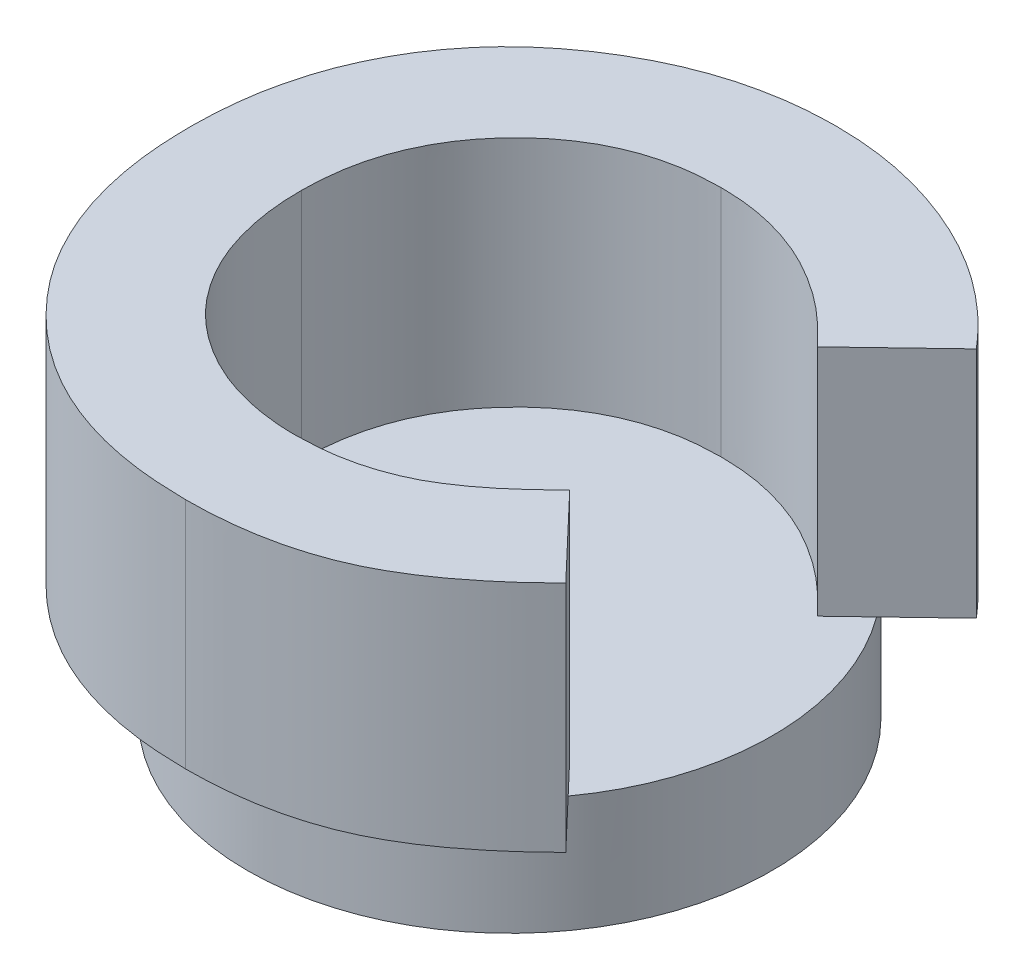
ISO-10303-21;
HEADER;
FILE_DESCRIPTION(('STEP AP214'),'2;1');
FILE_NAME('part.step','',(''),(''),'','','');
FILE_SCHEMA(('AUTOMOTIVE_DESIGN { 1 0 10303 214 1 1 1 1 }'));
ENDSEC;
DATA;
#1=APPLICATION_CONTEXT('core data for automotive mechanical design processes');
#2=APPLICATION_PROTOCOL_DEFINITION('international standard','automotive_design',2000,#1);
#3=PRODUCT_CONTEXT('',#1,'mechanical');
#4=PRODUCT('Part','Part','',(#3));
#5=PRODUCT_RELATED_PRODUCT_CATEGORY('part','',(#4));
#6=PRODUCT_DEFINITION_FORMATION('','',#4);
#7=PRODUCT_DEFINITION_CONTEXT('part definition',#1,'design');
#8=PRODUCT_DEFINITION('design','',#6,#7);
#9=PRODUCT_DEFINITION_SHAPE('','',#8);
#10=(LENGTH_UNIT() NAMED_UNIT(*) SI_UNIT(.MILLI.,.METRE.));
#11=(NAMED_UNIT(*) PLANE_ANGLE_UNIT() SI_UNIT($,.RADIAN.));
#12=(NAMED_UNIT(*) SI_UNIT($,.STERADIAN.) SOLID_ANGLE_UNIT());
#13=UNCERTAINTY_MEASURE_WITH_UNIT(LENGTH_MEASURE(1.E-05),#10,'distance_accuracy_value','');
#14=(GEOMETRIC_REPRESENTATION_CONTEXT(3) GLOBAL_UNCERTAINTY_ASSIGNED_CONTEXT((#13)) GLOBAL_UNIT_ASSIGNED_CONTEXT((#10,
#11,#12)) REPRESENTATION_CONTEXT('',''));
#15=CARTESIAN_POINT('',(0.,0.,0.));
#16=DIRECTION('',(0.,0.,1.));
#17=DIRECTION('',(1.,0.,0.));
#18=AXIS2_PLACEMENT_3D('',#15,#16,#17);
#19=CARTESIAN_POINT('',(0.,10.,0.));
#20=DIRECTION('',(0.,1.,0.));
#21=DIRECTION('',(0.,0.,1.));
#22=AXIS2_PLACEMENT_3D('',#19,#20,#21);
#23=PLANE('',#22);
#24=CARTESIAN_POINT('',(0.,10.,0.));
#25=DIRECTION('',(0.,1.,0.));
#26=DIRECTION('',(0.,0.,1.));
#27=AXIS2_PLACEMENT_3D('',#24,#25,#26);
#28=CIRCLE('',#27,22.5);
#29=CARTESIAN_POINT('',(18.2151132131534,10.,13.2083174792251));
#30=VERTEX_POINT('',#29);
#31=CARTESIAN_POINT('',(18.1408065157428,10.,-13.3101892908548));
#32=VERTEX_POINT('',#31);
#33=EDGE_CURVE('E52',#30,#32,#28,.T.);
#34=ORIENTED_EDGE('',*,*,#33,.T.);
#35=DIRECTION('',(-0.722880768094852,0.,0.690972788985642));
#36=VECTOR('',#35,1.);
#37=CARTESIAN_POINT('',(22.5143564905709,10.,-17.490690636657));
#38=LINE('',#37,#36);
#39=CARTESIAN_POINT('',(15.5499634617247,10.,-10.83370612811));
#40=VERTEX_POINT('',#39);
#41=EDGE_CURVE('E11',#32,#40,#38,.T.);
#42=ORIENTED_EDGE('',*,*,#41,.T.);
#43=CARTESIAN_POINT('',(15.5499634617247,10.,-10.83370612811));
#44=CARTESIAN_POINT('',(14.9591869074458,10.,-11.4445700753948));
#45=CARTESIAN_POINT('',(13.8052152127126,10.,-12.6377787418424));
#46=CARTESIAN_POINT('',(11.9457325423966,10.,-14.2174818623852));
#47=CARTESIAN_POINT('',(10.0119382698477,10.,-15.5339506716564));
#48=CARTESIAN_POINT('',(8.04145050264836,10.,-16.6426723212077));
#49=CARTESIAN_POINT('',(5.99882587807109,10.,-17.4814992675733));
#50=CARTESIAN_POINT('',(3.90768269906654,10.,-18.0927665928095));
#51=CARTESIAN_POINT('',(1.75466840134324,10.,-18.4654331768366));
#52=CARTESIAN_POINT('',(0.297591136050955,10.,-18.5080728293864));
#53=CARTESIAN_POINT('',(-0.435279593830849,10.,-18.529519429392));
#54=B_SPLINE_CURVE_WITH_KNOTS('',3,(#43,#44,#45,#46,#47,#48,#49,#50,#51,#52,#53),.UNSPECIFIED.,
.F.,.F.,(4,1,1,1,1,1,1,1,4),(0.,0.139406438181739,0.272304448374159,0.399525336271758,
0.522810878257822,0.642662716591868,0.761022620809522,0.879800796783804,1.),.UNSPECIFIED.);
#55=CARTESIAN_POINT('',(-0.435279593830849,10.,-18.529519429392));
#56=VERTEX_POINT('',#55);
#57=EDGE_CURVE('E277',#40,#56,#54,.T.);
#58=ORIENTED_EDGE('',*,*,#57,.T.);
#59=CARTESIAN_POINT('',(-0.435279593830849,10.,-18.529519429392));
#60=CARTESIAN_POINT('',(-1.04731571420529,10.,-18.5125758656857));
#61=CARTESIAN_POINT('',(-2.25510156534147,10.,-18.4791396095057));
#62=CARTESIAN_POINT('',(-4.02844769503839,10.,-18.2340188725268));
#63=CARTESIAN_POINT('',(-5.72474491644711,9.99999999999999,-17.8171803918288));
#64=CARTESIAN_POINT('',(-7.34979992377127,10.,-17.2426997510778));
#65=CARTESIAN_POINT('',(-8.89883092286301,10.,-16.4993522927301));
#66=CARTESIAN_POINT('',(-10.3750856497332,10.,-15.5877133483766));
#67=CARTESIAN_POINT('',(-11.7749244595818,10.,-14.5160163142426));
#68=CARTESIAN_POINT('',(-13.0798562926369,10.,-13.2898062000789));
#69=CARTESIAN_POINT('',(-14.2735620734045,10.,-11.9500795045214));
#70=CARTESIAN_POINT('',(-15.3282771382401,10.,-10.5205943163294));
#71=CARTESIAN_POINT('',(-16.2117701912234,10.,-9.00462550616221));
#72=CARTESIAN_POINT('',(-16.9368385688756,10.,-7.41752569177955));
#73=CARTESIAN_POINT('',(-17.501638806587,10.,-5.75194898966486));
#74=CARTESIAN_POINT('',(-17.9049771366345,10.,-4.00901673202257));
#75=CARTESIAN_POINT('',(-18.1382572476456,10.,-2.1866532212269));
#76=CARTESIAN_POINT('',(-18.1730758676047,10.,-0.947824085566511));
#77=CARTESIAN_POINT('',(-18.1907717145573,10.,-0.318214675118497));
#78=B_SPLINE_CURVE_WITH_KNOTS('',3,(#59,#60,#61,#62,#63,#64,#65,#66,#67,#68,#69,#70,#71,#72,#73,
#74,#75,#76,#77),.UNSPECIFIED.,.F.,.F.,(4,1,1,1,1,1,1,1,1,1,1,1,1,1,1,1,4),(0.,
0.0647145165408359,0.127706968329453,0.188882162817117,0.249158298722329,0.309661028748886,
0.370224886057185,0.432332221972585,0.495781858993871,0.559304076520427,0.621860558361524,
0.683321537332506,0.744522974782334,0.806088371210511,0.868994314670206,0.933419056808136,1.),.UNSPECIFIED.);
#79=CARTESIAN_POINT('',(-18.1907717145573,10.,-0.318214675118497));
#80=VERTEX_POINT('',#79);
#81=EDGE_CURVE('E278',#56,#80,#78,.T.);
#82=ORIENTED_EDGE('',*,*,#81,.T.);
#83=CARTESIAN_POINT('',(-18.1907717145573,10.,-0.318214675118497));
#84=CARTESIAN_POINT('',(-18.1856719732768,10.,0.123689261414383));
#85=CARTESIAN_POINT('',(-18.1756202784338,10.,0.99469099964418));
#86=CARTESIAN_POINT('',(-18.0655867025897,10.,2.28314430851664));
#87=CARTESIAN_POINT('',(-17.8884066994735,10.,3.53324862285155));
#88=CARTESIAN_POINT('',(-17.6319833376791,10.,4.74311036776408));
#89=CARTESIAN_POINT('',(-17.3113234030118,10.,5.91377802029476));
#90=CARTESIAN_POINT('',(-16.9351162857979,10.,7.05535087070262));
#91=CARTESIAN_POINT('',(-16.4631699912956,10.,8.15205495260398));
#92=CARTESIAN_POINT('',(-15.939302483551,10.,9.2166277719864));
#93=CARTESIAN_POINT('',(-15.3300506089892,10.,10.2200211268788));
#94=CARTESIAN_POINT('',(-14.6731646961762,10.,11.1768399650871));
#95=CARTESIAN_POINT('',(-13.9608791714441,10.,12.0823940559434));
#96=CARTESIAN_POINT('',(-13.1885805192552,10.,12.932981466665));
#97=CARTESIAN_POINT('',(-12.3453995972404,10.,13.7153094209763));
#98=CARTESIAN_POINT('',(-11.4531295124361,10.,14.4529034513255));
#99=CARTESIAN_POINT('',(-10.4967189031942,10.,15.1272990807738));
#100=CARTESIAN_POINT('',(-9.49603484163499,10.,15.7554210102447));
#101=CARTESIAN_POINT('',(-8.4424326820309,10.,16.3010758742813));
#102=CARTESIAN_POINT('',(-7.3644990937911,10.,16.7953337643117));
#103=CARTESIAN_POINT('',(-6.245890431161,10.,17.1967446565325));
#104=CARTESIAN_POINT('',(-5.10022642647172,10.,17.5203184557415));
#105=CARTESIAN_POINT('',(-3.93160127908117,10.,17.795469646707));
#106=CARTESIAN_POINT('',(-2.72858474969151,10.,17.9648886910839));
#107=CARTESIAN_POINT('',(-1.50160548504139,10.,18.0931877504378));
#108=CARTESIAN_POINT('',(-0.672373449924424,10.,18.1011094674212));
#109=CARTESIAN_POINT('',(-0.25507459917273,10.,18.1050959552234));
#110=B_SPLINE_CURVE_WITH_KNOTS('',3,(#83,#84,#85,#86,#87,#88,#89,#90,#91,#92,#93,#94,#95,#96,
#97,#98,#99,#100,#101,#102,#103,#104,#105,#106,#107,#108,#109),.UNSPECIFIED.,.F.,.F.,(4,1,1,1,1,
1,1,1,1,1,1,1,1,1,1,1,1,1,1,1,1,1,1,1,4),(0.,0.0459858533955717,0.0906390618643955,
0.134485273386869,0.177331356125942,0.219264832978247,0.260785002358145,0.302316572337849,
0.343435729403752,0.384181473765631,0.424375738997743,0.464181121951782,0.50401198252761,
0.543822462310405,0.583802464576023,0.624418535098885,0.665547559578536,0.706674939653633,
0.747826978897574,0.788895116557047,0.830219357972813,0.871706936947863,0.913733853604737,
0.956587827984187,1.),.UNSPECIFIED.);
#111=CARTESIAN_POINT('',(-0.25507459917273,10.,18.1050959552234));
#112=VERTEX_POINT('',#111);
#113=EDGE_CURVE('E294',#80,#112,#110,.T.);
#114=ORIENTED_EDGE('',*,*,#113,.T.);
#115=CARTESIAN_POINT('',(-0.25507459917273,10.,18.1050959552234));
#116=CARTESIAN_POINT('',(0.452735966373527,10.,18.0846223175129));
#117=CARTESIAN_POINT('',(1.84339966919909,10.,18.0443969433595));
#118=CARTESIAN_POINT('',(3.88439861278427,10.,17.7298402134845));
#119=CARTESIAN_POINT('',(5.82926727261556,10.,17.2124121934386));
#120=CARTESIAN_POINT('',(7.38320802507008,10.,16.6013597674288));
#121=CARTESIAN_POINT('',(8.60067955919089,10.,15.997937563906));
#122=CARTESIAN_POINT('',(9.52752264011862,10.,15.4398017409865));
#123=CARTESIAN_POINT('',(10.4859506236859,10.,14.8154655431374));
#124=CARTESIAN_POINT('',(11.4600448407193,10.,14.1013658461382));
#125=CARTESIAN_POINT('',(12.4607619188372,10.,13.3060721327053));
#126=CARTESIAN_POINT('',(13.470436894132,10.,12.4121659866184));
#127=CARTESIAN_POINT('',(14.5149176252764,10.,11.4490824549399));
#128=CARTESIAN_POINT('',(15.1991465988771,10.,10.761710818309));
#129=CARTESIAN_POINT('',(15.5499634617247,10.,10.4092826539413));
#130=B_SPLINE_CURVE_WITH_KNOTS('',3,(#115,#116,#117,#118,#119,#120,#121,#122,#123,#124,#125,
#126,#127,#128,#129),.UNSPECIFIED.,.F.,.F.,(4,1,1,1,1,1,1,1,1,1,1,1,4),(0.,0.117048429048343,
0.229969725903514,0.340703507658765,0.449355146911558,0.50555651152082,0.565302669775755,
0.628204956476601,0.694728991831127,0.765018833651914,0.839580202195728,0.917749799590947,1.),.UNSPECIFIED.);
#131=CARTESIAN_POINT('',(15.5499634617247,10.,10.4092826539413));
#132=VERTEX_POINT('',#131);
#133=EDGE_CURVE('E302',#112,#132,#130,.T.);
#134=ORIENTED_EDGE('',*,*,#133,.T.);
#135=DIRECTION('',(0.689574074589039,0.,0.724215158398849));
#136=VECTOR('',#135,1.);
#137=CARTESIAN_POINT('',(15.5499634617247,10.,10.4092826539413));
#138=LINE('',#137,#136);
#139=EDGE_CURVE('E269',#132,#30,#138,.T.);
#140=ORIENTED_EDGE('',*,*,#139,.T.);
#141=EDGE_LOOP('',(#34,#42,#58,#82,#114,#134,#140));
#142=FACE_BOUND('',#141,.T.);
#143=ADVANCED_FACE('F43',(#142),#23,.T.);
#144=CARTESIAN_POINT('',(0.,10.,0.));
#145=DIRECTION('',(0.,-1.,0.));
#146=DIRECTION('',(0.,0.,-1.));
#147=AXIS2_PLACEMENT_3D('',#144,#145,#146);
#148=CYLINDRICAL_SURFACE('',#147,22.5);
#149=ORIENTED_EDGE('',*,*,#33,.F.);
#150=EDGE_CURVE('E234',#32,#30,#28,.T.);
#151=ORIENTED_EDGE('',*,*,#150,.F.);
#152=EDGE_LOOP('',(#149,#151));
#153=FACE_BOUND('',#152,.T.);
#154=CARTESIAN_POINT('',(0.,0.,0.));
#155=DIRECTION('',(0.,1.,0.));
#156=DIRECTION('',(0.,0.,1.));
#157=AXIS2_PLACEMENT_3D('',#154,#155,#156);
#158=CIRCLE('',#157,22.5);
#159=CARTESIAN_POINT('',(0.,0.,22.5));
#160=VERTEX_POINT('',#159);
#161=EDGE_CURVE('E47',#160,#160,#158,.T.);
#162=ORIENTED_EDGE('',*,*,#161,.T.);
#163=EDGE_LOOP('',(#162));
#164=FACE_BOUND('',#163,.T.);
#165=ADVANCED_FACE('F45',(#153,#164),#148,.T.);
#166=CARTESIAN_POINT('',(0.,0.,0.));
#167=DIRECTION('',(0.,1.,0.));
#168=DIRECTION('',(0.,0.,1.));
#169=AXIS2_PLACEMENT_3D('',#166,#167,#168);
#170=PLANE('',#169);
#171=CARTESIAN_POINT('',(0.,0.,0.));
#172=DIRECTION('',(0.,-1.,0.));
#173=DIRECTION('',(0.,0.,-1.));
#174=AXIS2_PLACEMENT_3D('',#171,#172,#173);
#175=CIRCLE('',#174,21.5);
#176=CARTESIAN_POINT('',(4.83856503950974,0.,20.9484674465326));
#177=VERTEX_POINT('',#176);
#178=CARTESIAN_POINT('',(-4.83856503950294,0.,20.9484674465341));
#179=VERTEX_POINT('',#178);
#180=EDGE_CURVE('E183',#177,#179,#175,.T.);
#181=ORIENTED_EDGE('',*,*,#180,.F.);
#182=DIRECTION('',(-0.471428571428459,0.,0.881904247660097));
#183=VECTOR('',#182,1.);
#184=CARTESIAN_POINT('',(12.4726457883362,0.,6.66734693877418));
#185=LINE('',#184,#183);
#186=CARTESIAN_POINT('',(14.5514200863916,0.,2.77857142856957));
#187=VERTEX_POINT('',#186);
#188=EDGE_CURVE('E61',#187,#177,#185,.T.);
#189=ORIENTED_EDGE('',*,*,#188,.F.);
#190=CARTESIAN_POINT('',(0.,0.,-5.));
#191=DIRECTION('',(0.,-1.,0.));
#192=DIRECTION('',(0.,0.,-1.));
#193=AXIS2_PLACEMENT_3D('',#190,#191,#192);
#194=CIRCLE('',#193,16.5);
#195=CARTESIAN_POINT('',(-14.5514200863896,0.,2.77857142857328));
#196=VERTEX_POINT('',#195);
#197=EDGE_CURVE('E174',#196,#187,#194,.T.);
#198=ORIENTED_EDGE('',*,*,#197,.F.);
#199=DIRECTION('',(-0.471428571428684,0.,-0.881904247659977));
#200=VECTOR('',#199,1.);
#201=CARTESIAN_POINT('',(-12.4726457883335,0.,6.66734693877684));
#202=LINE('',#201,#200);
#203=EDGE_CURVE('E177',#179,#196,#202,.T.);
#204=ORIENTED_EDGE('',*,*,#203,.F.);
#205=EDGE_LOOP('',(#181,#189,#198,#204));
#206=FACE_BOUND('',#205,.T.);
#207=ORIENTED_EDGE('',*,*,#161,.F.);
#208=EDGE_LOOP('',(#207));
#209=FACE_BOUND('',#208,.T.);
#210=ADVANCED_FACE('F217',(#206,#209),#170,.F.);
#211=CARTESIAN_POINT('',(12.3801652551055,10.,-25.2378091890381));
#212=DIRECTION('',(0.,1.,0.));
#213=DIRECTION('',(0.,0.,1.));
#214=AXIS2_PLACEMENT_3D('',#211,#212,#213);
#215=PLANE('',#214);
#216=CARTESIAN_POINT('',(22.5143564905709,10.,-17.490690636657));
#217=VERTEX_POINT('',#216);
#218=EDGE_CURVE('E54',#217,#32,#38,.T.);
#219=ORIENTED_EDGE('',*,*,#218,.T.);
#220=ORIENTED_EDGE('',*,*,#150,.T.);
#221=CARTESIAN_POINT('',(22.3023506145025,10.,17.5008792084285));
#222=VERTEX_POINT('',#221);
#223=EDGE_CURVE('E69',#30,#222,#138,.T.);
#224=ORIENTED_EDGE('',*,*,#223,.T.);
#225=CARTESIAN_POINT('',(22.3023506145025,10.,17.5008792084285));
#226=CARTESIAN_POINT('',(21.8276941428724,10.,17.959145130206));
#227=CARTESIAN_POINT('',(20.9012662187933,10.,18.8535822062043));
#228=CARTESIAN_POINT('',(19.5037754139792,10.,20.1235993904037));
#229=CARTESIAN_POINT('',(18.1080434066188,10.,21.2648510126769));
#230=CARTESIAN_POINT('',(16.7477881743605,10.,22.3187595051148));
#231=CARTESIAN_POINT('',(15.4007273178029,10.,23.2546219536193));
#232=CARTESIAN_POINT('',(14.0670036905199,10.,24.0733730151369));
#233=CARTESIAN_POINT('',(12.7617156269646,10.,24.7957200883414));
#234=CARTESIAN_POINT('',(11.4577584022983,10.,25.409481144164));
#235=CARTESIAN_POINT('',(10.1470181216665,10.,25.9306280255489));
#236=CARTESIAN_POINT('',(8.79842040583182,10.,26.3793012842656));
#237=CARTESIAN_POINT('',(7.40784246468599,10.,26.7588627201485));
#238=CARTESIAN_POINT('',(5.96679128270507,10.,27.0651189502026));
#239=CARTESIAN_POINT('',(4.48870810720689,10.,27.3106951021495));
#240=CARTESIAN_POINT('',(2.95976004354013,10.,27.4764575842963));
#241=CARTESIAN_POINT('',(1.38964137746563,10.,27.5878941860739));
#242=CARTESIAN_POINT('',(0.324605561214052,10.,27.5979076882126));
#243=CARTESIAN_POINT('',(-0.212673423959052,10.,27.6029592030866));
#244=B_SPLINE_CURVE_WITH_KNOTS('',3,(#225,#226,#227,#228,#229,#230,#231,#232,#233,#234,#235,
#236,#237,#238,#239,#240,#241,#242,#243),.UNSPECIFIED.,.F.,.F.,(4,1,1,1,1,1,1,1,1,1,1,1,1,1,1,1,
4),(0.,0.0777829363133484,0.151815657269109,0.222539838580063,0.290277534682293,
0.35464060748638,0.415797753485032,0.474709007669868,0.530426099620043,0.585579745825266,
0.640906164804031,0.697901090665671,0.755420320880605,0.814521258487291,0.874461831215908,
0.936669716740424,1.),.UNSPECIFIED.);
#245=CARTESIAN_POINT('',(-0.212673423959052,10.,27.6029592030866));
#246=VERTEX_POINT('',#245);
#247=EDGE_CURVE('E313',#222,#246,#244,.T.);
#248=ORIENTED_EDGE('',*,*,#247,.T.);
#249=CARTESIAN_POINT('',(-0.212673423959052,10.,27.6029592030866));
#250=CARTESIAN_POINT('',(-1.19958836697909,10.,27.5778007730058));
#251=CARTESIAN_POINT('',(-3.13070658054027,10.,27.5285727185546));
#252=CARTESIAN_POINT('',(-5.96070997172895,10.,27.1638261653596));
#253=CARTESIAN_POINT('',(-8.64913722647972,10.,26.5523349945493));
#254=CARTESIAN_POINT('',(-11.2025287850253,10.,25.6875178161007));
#255=CARTESIAN_POINT('',(-13.6200727282836,10.,24.582754401149));
#256=CARTESIAN_POINT('',(-15.9011505747822,10.,23.2283663298341));
#257=CARTESIAN_POINT('',(-18.0420857341486,10.,21.6279519977142));
#258=CARTESIAN_POINT('',(-20.0255836643499,10.,19.8002698145508));
#259=CARTESIAN_POINT('',(-21.8197519408171,10.,17.781748276027));
#260=CARTESIAN_POINT('',(-23.4055889221554,10.,15.6144099055198));
#261=CARTESIAN_POINT('',(-24.7173933329303,10.,13.287603029042));
#262=CARTESIAN_POINT('',(-25.8066128013936,10.,10.8357020169592));
#263=CARTESIAN_POINT('',(-26.6583681005495,10.,8.24751789256044));
#264=CARTESIAN_POINT('',(-27.2578594350629,10.,5.52025102885824));
#265=CARTESIAN_POINT('',(-27.6275613659165,10.,2.6565347706426));
#266=CARTESIAN_POINT('',(-27.668007282554,10.,0.700550552591196));
#267=CARTESIAN_POINT('',(-27.6886349624206,10.,-0.297014087511659));
#268=B_SPLINE_CURVE_WITH_KNOTS('',3,(#249,#250,#251,#252,#253,#254,#255,#256,#257,#258,#259,
#260,#261,#262,#263,#264,#265,#266,#267),.UNSPECIFIED.,.F.,.F.,(4,1,1,1,1,1,1,1,1,1,1,1,1,1,1,1,
4),(0.,0.0673762427992636,0.13183657877631,0.194461067601586,0.255345967743414,
0.315588340013611,0.375627451772199,0.436137852052541,0.497778619574713,0.559470361094052,
0.620277769679113,0.680787688960419,0.741491621591654,0.80321543625319,0.866492762748931,
0.931910442911361,1.),.UNSPECIFIED.);
#269=CARTESIAN_POINT('',(-27.6886349624206,10.,-0.297014087511659));
#270=VERTEX_POINT('',#269);
#271=EDGE_CURVE('E316',#246,#270,#268,.T.);
#272=ORIENTED_EDGE('',*,*,#271,.T.);
#273=CARTESIAN_POINT('',(-27.6886349624206,10.,-0.297014087511659));
#274=CARTESIAN_POINT('',(-27.6799187046508,10.,-0.947617234720453));
#275=CARTESIAN_POINT('',(-27.6626452120743,10.,-2.23695365986115));
#276=CARTESIAN_POINT('',(-27.4810992053752,10.,-4.13625067262962));
#277=CARTESIAN_POINT('',(-27.2280135156697,10.,-5.98772552773401));
#278=CARTESIAN_POINT('',(-26.8265160822482,9.99999999999999,-7.77215378098965));
#279=CARTESIAN_POINT('',(-26.3425505253378,10.,-9.51357497202743));
#280=CARTESIAN_POINT('',(-25.7406757695045,10.,-11.1930618862512));
#281=CARTESIAN_POINT('',(-25.0218530918877,10.,-12.8154415381689));
#282=CARTESIAN_POINT('',(-24.2092518401184,10.,-14.3834298888182));
#283=CARTESIAN_POINT('',(-23.2899641739735,10.,-15.8867549344528));
#284=CARTESIAN_POINT('',(-22.2630189319479,10.,-17.3125007436801));
#285=CARTESIAN_POINT('',(-21.1548536890998,10.,-18.6716738116589));
#286=CARTESIAN_POINT('',(-19.9388410399947,10.,-19.9462421845147));
#287=CARTESIAN_POINT('',(-18.6326512416447,10.,-21.1473968203463));
#288=CARTESIAN_POINT('',(-17.230386996818,10.,-22.2686284320769));
#289=CARTESIAN_POINT('',(-15.7404822244964,10.,-23.3260167459675));
#290=CARTESIAN_POINT('',(-14.1589043064577,10.,-24.2922942837688));
#291=CARTESIAN_POINT('',(-12.5163790874067,10.,-25.1663436763688));
#292=CARTESIAN_POINT('',(-10.8336231328385,10.,-25.9372925705019));
#293=CARTESIAN_POINT('',(-9.11477077889716,10.,-26.581628309415));
#294=CARTESIAN_POINT('',(-7.36708948905583,10.,-27.1160810365801));
#295=CARTESIAN_POINT('',(-5.58319533226864,10.,-27.5150122072165));
#296=CARTESIAN_POINT('',(-3.77582129103566,10.,-27.816990233721));
#297=CARTESIAN_POINT('',(-1.92958878258304,10.,-27.9857978812709));
#298=CARTESIAN_POINT('',(-0.690003597018445,10.,-28.0134327705348));
#299=CARTESIAN_POINT('',(-0.0642693107111882,10.,-28.0273826772552));
#300=B_SPLINE_CURVE_WITH_KNOTS('',3,(#273,#274,#275,#276,#277,#278,#279,#280,#281,#282,#283,
#284,#285,#286,#287,#288,#289,#290,#291,#292,#293,#294,#295,#296,#297,#298,#299),.UNSPECIFIED.,
.F.,.F.,(4,1,1,1,1,1,1,1,1,1,1,1,1,1,1,1,1,1,1,1,1,1,1,1,4),(0.,0.0446633309063708,
0.0885118057801453,0.130925591301777,0.172904037280887,0.214000119904966,0.254985020358983,
0.295291276387059,0.335772441952788,0.37618082055377,0.41617840847452,0.456350051444474,
0.496512166644416,0.53704057363778,0.578118744007762,0.619724560554812,0.662421970198883,
0.705298953520903,0.747430000533911,0.789432984039383,0.831267421203061,0.872825095964229,
0.914870110484392,0.9570270028395,1.),.UNSPECIFIED.);
#301=CARTESIAN_POINT('',(-0.0642693107111882,10.,-28.0273826772552));
#302=VERTEX_POINT('',#301);
#303=EDGE_CURVE('E200',#270,#302,#300,.T.);
#304=ORIENTED_EDGE('',*,*,#303,.T.);
#305=CARTESIAN_POINT('',(-0.0642693107111882,10.,-28.0273826772552));
#306=CARTESIAN_POINT('',(0.46954619450159,10.,-28.0193862426614));
#307=CARTESIAN_POINT('',(1.531627009689,10.,-28.0034765141334));
#308=CARTESIAN_POINT('',(3.11324356799189,10.,-27.8708516163256));
#309=CARTESIAN_POINT('',(4.68221109754644,10.,-27.6625655558615));
#310=CARTESIAN_POINT('',(6.23291221313175,10.,-27.3483062470545));
#311=CARTESIAN_POINT('',(7.77643911436148,10.,-26.9752407346845));
#312=CARTESIAN_POINT('',(9.29250812812968,10.,-26.4867629060376));
#313=CARTESIAN_POINT('',(10.805036062929,10.,-25.9422623118495));
#314=CARTESIAN_POINT('',(12.2903011643401,10.,-25.2914230318754));
#315=CARTESIAN_POINT('',(13.7503766446723,10.,-24.5809731684235));
#316=CARTESIAN_POINT('',(15.1510579361483,10.,-23.7749419977545));
#317=CARTESIAN_POINT('',(16.515862348137,10.,-22.922931777979));
#318=CARTESIAN_POINT('',(17.8145466342809,9.99999999999999,-21.974516811226));
#319=CARTESIAN_POINT('',(19.0714379477314,10.,-20.9640978717687));
#320=CARTESIAN_POINT('',(20.2799638938839,10.,-19.8869607879445));
#321=CARTESIAN_POINT('',(21.4295189508964,10.,-18.7251465222367));
#322=CARTESIAN_POINT('',(22.1509158761969,10.,-17.9042561605853));
#323=CARTESIAN_POINT('',(22.5143564905709,10.,-17.490690636657));
#324=B_SPLINE_CURVE_WITH_KNOTS('',3,(#305,#306,#307,#308,#309,#310,#311,#312,#313,#314,#315,
#316,#317,#318,#319,#320,#321,#322,#323),.UNSPECIFIED.,.F.,.F.,(4,1,1,1,1,1,1,1,1,1,1,1,1,1,1,1,
4),(0.,0.0622757783707705,0.123904062007518,0.185067240768728,0.246840151520206,
0.308435329849778,0.370241250709108,0.432586588879854,0.495924581661242,0.559351070950926,
0.621942654201091,0.684392867235184,0.746985808264523,0.809441464531699,0.872507832713939,
0.935769297066228,1.),.UNSPECIFIED.);
#325=EDGE_CURVE('E189',#302,#217,#324,.T.);
#326=ORIENTED_EDGE('',*,*,#325,.T.);
#327=EDGE_LOOP('',(#219,#220,#224,#248,#272,#304,#326));
#328=FACE_BOUND('',#327,.T.);
#329=ADVANCED_FACE('F211',(#328),#215,.F.);
#330=CARTESIAN_POINT('',(-0.0642693107111882,30.,-28.0273826772552));
#331=CARTESIAN_POINT('',(0.46954619450159,30.,-28.0193862426614));
#332=CARTESIAN_POINT('',(1.531627009689,30.,-28.0034765141334));
#333=CARTESIAN_POINT('',(3.11324356799189,30.,-27.8708516163256));
#334=CARTESIAN_POINT('',(4.68221109754644,30.,-27.6625655558615));
#335=CARTESIAN_POINT('',(6.23291221313175,30.,-27.3483062470545));
#336=CARTESIAN_POINT('',(7.77643911436148,30.,-26.9752407346845));
#337=CARTESIAN_POINT('',(9.29250812812968,30.,-26.4867629060376));
#338=CARTESIAN_POINT('',(10.805036062929,30.,-25.9422623118495));
#339=CARTESIAN_POINT('',(12.2903011643401,30.,-25.2914230318754));
#340=CARTESIAN_POINT('',(13.7503766446723,30.,-24.5809731684235));
#341=CARTESIAN_POINT('',(15.1510579361483,30.,-23.7749419977545));
#342=CARTESIAN_POINT('',(16.515862348137,30.,-22.922931777979));
#343=CARTESIAN_POINT('',(17.8145466342809,30.,-21.974516811226));
#344=CARTESIAN_POINT('',(19.0714379477314,30.,-20.9640978717687));
#345=CARTESIAN_POINT('',(20.2799638938839,30.,-19.8869607879445));
#346=CARTESIAN_POINT('',(21.4295189508964,30.,-18.7251465222367));
#347=CARTESIAN_POINT('',(22.1509158761969,30.,-17.9042561605853));
#348=CARTESIAN_POINT('',(22.5143564905709,30.,-17.490690636657));
#349=B_SPLINE_CURVE_WITH_KNOTS('',3,(#330,#331,#332,#333,#334,#335,#336,#337,#338,#339,#340,
#341,#342,#343,#344,#345,#346,#347,#348),.UNSPECIFIED.,.F.,.F.,(4,1,1,1,1,1,1,1,1,1,1,1,1,1,1,1,
4),(0.,0.0622757783707705,0.123904062007518,0.185067240768728,0.246840151520206,
0.308435329849778,0.370241250709108,0.432586588879854,0.495924581661242,0.559351070950926,
0.621942654201091,0.684392867235184,0.746985808264523,0.809441464531699,0.872507832713939,
0.935769297066228,1.),.UNSPECIFIED.);
#350=DIRECTION('',(0.,-1.,0.));
#351=VECTOR('',#350,1.);
#352=SURFACE_OF_LINEAR_EXTRUSION('',#349,#351);
#353=ORIENTED_EDGE('',*,*,#325,.F.);
#354=DIRECTION('',(0.,-1.,0.));
#355=VECTOR('',#354,1.);
#356=CARTESIAN_POINT('',(-0.0642693107111882,30.,-28.0273826772552));
#357=LINE('',#356,#355);
#358=CARTESIAN_POINT('',(-0.0642693107111882,30.,-28.0273826772552));
#359=VERTEX_POINT('',#358);
#360=EDGE_CURVE('E235',#359,#302,#357,.T.);
#361=ORIENTED_EDGE('',*,*,#360,.F.);
#362=CARTESIAN_POINT('',(22.5143564905709,30.,-17.490690636657));
#363=VERTEX_POINT('',#362);
#364=EDGE_CURVE('E193',#359,#363,#349,.T.);
#365=ORIENTED_EDGE('',*,*,#364,.T.);
#366=DIRECTION('',(0.,-1.,0.));
#367=VECTOR('',#366,1.);
#368=CARTESIAN_POINT('',(22.5143564905709,30.,-17.490690636657));
#369=LINE('',#368,#367);
#370=EDGE_CURVE('E262',#363,#217,#369,.T.);
#371=ORIENTED_EDGE('',*,*,#370,.T.);
#372=EDGE_LOOP('',(#353,#361,#365,#371));
#373=FACE_BOUND('',#372,.T.);
#374=ADVANCED_FACE('F206',(#373),#352,.T.);
#375=CARTESIAN_POINT('',(-27.6886349624206,30.,-0.297014087511659));
#376=CARTESIAN_POINT('',(-27.6799187046508,30.,-0.947617234720453));
#377=CARTESIAN_POINT('',(-27.6626452120743,30.,-2.23695365986115));
#378=CARTESIAN_POINT('',(-27.4810992053752,30.,-4.13625067262962));
#379=CARTESIAN_POINT('',(-27.2280135156697,30.,-5.98772552773401));
#380=CARTESIAN_POINT('',(-26.8265160822482,30.,-7.77215378098965));
#381=CARTESIAN_POINT('',(-26.3425505253378,30.,-9.51357497202743));
#382=CARTESIAN_POINT('',(-25.7406757695045,30.,-11.1930618862512));
#383=CARTESIAN_POINT('',(-25.0218530918877,30.,-12.8154415381689));
#384=CARTESIAN_POINT('',(-24.2092518401184,30.,-14.3834298888182));
#385=CARTESIAN_POINT('',(-23.2899641739735,30.,-15.8867549344528));
#386=CARTESIAN_POINT('',(-22.2630189319479,30.,-17.3125007436801));
#387=CARTESIAN_POINT('',(-21.1548536890998,30.,-18.6716738116589));
#388=CARTESIAN_POINT('',(-19.9388410399947,30.,-19.9462421845147));
#389=CARTESIAN_POINT('',(-18.6326512416447,30.,-21.1473968203463));
#390=CARTESIAN_POINT('',(-17.230386996818,30.,-22.2686284320769));
#391=CARTESIAN_POINT('',(-15.7404822244964,30.,-23.3260167459675));
#392=CARTESIAN_POINT('',(-14.1589043064577,30.,-24.2922942837688));
#393=CARTESIAN_POINT('',(-12.5163790874067,30.,-25.1663436763688));
#394=CARTESIAN_POINT('',(-10.8336231328385,30.,-25.9372925705019));
#395=CARTESIAN_POINT('',(-9.11477077889716,30.,-26.581628309415));
#396=CARTESIAN_POINT('',(-7.36708948905583,30.,-27.1160810365801));
#397=CARTESIAN_POINT('',(-5.58319533226864,30.,-27.5150122072165));
#398=CARTESIAN_POINT('',(-3.77582129103566,30.,-27.816990233721));
#399=CARTESIAN_POINT('',(-1.92958878258304,30.,-27.9857978812709));
#400=CARTESIAN_POINT('',(-0.690003597018445,30.,-28.0134327705348));
#401=CARTESIAN_POINT('',(-0.0642693107111882,30.,-28.0273826772552));
#402=B_SPLINE_CURVE_WITH_KNOTS('',3,(#375,#376,#377,#378,#379,#380,#381,#382,#383,#384,#385,
#386,#387,#388,#389,#390,#391,#392,#393,#394,#395,#396,#397,#398,#399,#400,#401),.UNSPECIFIED.,
.F.,.F.,(4,1,1,1,1,1,1,1,1,1,1,1,1,1,1,1,1,1,1,1,1,1,1,1,4),(0.,0.0446633309063708,
0.0885118057801453,0.130925591301777,0.172904037280887,0.214000119904966,0.254985020358983,
0.295291276387059,0.335772441952788,0.37618082055377,0.41617840847452,0.456350051444474,
0.496512166644416,0.53704057363778,0.578118744007762,0.619724560554812,0.662421970198883,
0.705298953520903,0.747430000533911,0.789432984039383,0.831267421203061,0.872825095964229,
0.914870110484392,0.9570270028395,1.),.UNSPECIFIED.);
#403=DIRECTION('',(0.,-1.,0.));
#404=VECTOR('',#403,1.);
#405=SURFACE_OF_LINEAR_EXTRUSION('',#402,#404);
#406=ORIENTED_EDGE('',*,*,#303,.F.);
#407=DIRECTION('',(0.,-1.,0.));
#408=VECTOR('',#407,1.);
#409=CARTESIAN_POINT('',(-27.6886349624206,30.,-0.297014087511659));
#410=LINE('',#409,#408);
#411=CARTESIAN_POINT('',(-27.6886349624206,30.,-0.297014087511659));
#412=VERTEX_POINT('',#411);
#413=EDGE_CURVE('E236',#412,#270,#410,.T.);
#414=ORIENTED_EDGE('',*,*,#413,.F.);
#415=EDGE_CURVE('E263',#412,#359,#402,.T.);
#416=ORIENTED_EDGE('',*,*,#415,.T.);
#417=ORIENTED_EDGE('',*,*,#360,.T.);
#418=EDGE_LOOP('',(#406,#414,#416,#417));
#419=FACE_BOUND('',#418,.T.);
#420=ADVANCED_FACE('F210',(#419),#405,.T.);
#421=CARTESIAN_POINT('',(-0.212673423959052,30.,27.6029592030866));
#422=CARTESIAN_POINT('',(-1.19958836697909,30.,27.5778007730058));
#423=CARTESIAN_POINT('',(-3.13070658054027,30.,27.5285727185546));
#424=CARTESIAN_POINT('',(-5.96070997172895,30.,27.1638261653596));
#425=CARTESIAN_POINT('',(-8.64913722647972,30.,26.5523349945493));
#426=CARTESIAN_POINT('',(-11.2025287850253,30.,25.6875178161007));
#427=CARTESIAN_POINT('',(-13.6200727282836,30.,24.582754401149));
#428=CARTESIAN_POINT('',(-15.9011505747822,30.,23.2283663298341));
#429=CARTESIAN_POINT('',(-18.0420857341486,30.,21.6279519977142));
#430=CARTESIAN_POINT('',(-20.0255836643499,30.,19.8002698145508));
#431=CARTESIAN_POINT('',(-21.8197519408171,30.,17.781748276027));
#432=CARTESIAN_POINT('',(-23.4055889221554,30.,15.6144099055198));
#433=CARTESIAN_POINT('',(-24.7173933329303,30.,13.287603029042));
#434=CARTESIAN_POINT('',(-25.8066128013936,30.,10.8357020169592));
#435=CARTESIAN_POINT('',(-26.6583681005495,30.,8.24751789256044));
#436=CARTESIAN_POINT('',(-27.2578594350629,30.,5.52025102885824));
#437=CARTESIAN_POINT('',(-27.6275613659165,30.,2.6565347706426));
#438=CARTESIAN_POINT('',(-27.668007282554,30.,0.700550552591196));
#439=CARTESIAN_POINT('',(-27.6886349624206,30.,-0.297014087511659));
#440=B_SPLINE_CURVE_WITH_KNOTS('',3,(#421,#422,#423,#424,#425,#426,#427,#428,#429,#430,#431,
#432,#433,#434,#435,#436,#437,#438,#439),.UNSPECIFIED.,.F.,.F.,(4,1,1,1,1,1,1,1,1,1,1,1,1,1,1,1,
4),(0.,0.0673762427992636,0.13183657877631,0.194461067601586,0.255345967743414,
0.315588340013611,0.375627451772199,0.436137852052541,0.497778619574713,0.559470361094052,
0.620277769679113,0.680787688960419,0.741491621591654,0.80321543625319,0.866492762748931,
0.931910442911361,1.),.UNSPECIFIED.);
#441=DIRECTION('',(0.,-1.,0.));
#442=VECTOR('',#441,1.);
#443=SURFACE_OF_LINEAR_EXTRUSION('',#440,#442);
#444=ORIENTED_EDGE('',*,*,#271,.F.);
#445=DIRECTION('',(0.,-1.,0.));
#446=VECTOR('',#445,1.);
#447=CARTESIAN_POINT('',(-0.212673423959052,30.,27.6029592030866));
#448=LINE('',#447,#446);
#449=CARTESIAN_POINT('',(-0.212673423959052,30.,27.6029592030866));
#450=VERTEX_POINT('',#449);
#451=EDGE_CURVE('E242',#450,#246,#448,.T.);
#452=ORIENTED_EDGE('',*,*,#451,.F.);
#453=EDGE_CURVE('E331',#450,#412,#440,.T.);
#454=ORIENTED_EDGE('',*,*,#453,.T.);
#455=ORIENTED_EDGE('',*,*,#413,.T.);
#456=EDGE_LOOP('',(#444,#452,#454,#455));
#457=FACE_BOUND('',#456,.T.);
#458=ADVANCED_FACE('F332',(#457),#443,.T.);
#459=CARTESIAN_POINT('',(22.3023506145025,30.,17.5008792084285));
#460=CARTESIAN_POINT('',(21.8276941428724,30.,17.959145130206));
#461=CARTESIAN_POINT('',(20.9012662187933,30.,18.8535822062043));
#462=CARTESIAN_POINT('',(19.5037754139792,30.,20.1235993904037));
#463=CARTESIAN_POINT('',(18.1080434066188,30.,21.2648510126769));
#464=CARTESIAN_POINT('',(16.7477881743605,30.,22.3187595051148));
#465=CARTESIAN_POINT('',(15.4007273178029,30.,23.2546219536193));
#466=CARTESIAN_POINT('',(14.0670036905199,30.,24.0733730151369));
#467=CARTESIAN_POINT('',(12.7617156269646,30.,24.7957200883414));
#468=CARTESIAN_POINT('',(11.4577584022983,30.,25.409481144164));
#469=CARTESIAN_POINT('',(10.1470181216665,30.,25.9306280255489));
#470=CARTESIAN_POINT('',(8.79842040583182,30.,26.3793012842656));
#471=CARTESIAN_POINT('',(7.40784246468599,30.,26.7588627201485));
#472=CARTESIAN_POINT('',(5.96679128270507,30.,27.0651189502026));
#473=CARTESIAN_POINT('',(4.48870810720689,30.,27.3106951021495));
#474=CARTESIAN_POINT('',(2.95976004354013,30.,27.4764575842963));
#475=CARTESIAN_POINT('',(1.38964137746563,30.,27.5878941860739));
#476=CARTESIAN_POINT('',(0.324605561214052,30.,27.5979076882126));
#477=CARTESIAN_POINT('',(-0.212673423959052,30.,27.6029592030866));
#478=B_SPLINE_CURVE_WITH_KNOTS('',3,(#459,#460,#461,#462,#463,#464,#465,#466,#467,#468,#469,
#470,#471,#472,#473,#474,#475,#476,#477),.UNSPECIFIED.,.F.,.F.,(4,1,1,1,1,1,1,1,1,1,1,1,1,1,1,1,
4),(0.,0.0777829363133484,0.151815657269109,0.222539838580063,0.290277534682293,
0.35464060748638,0.415797753485032,0.474709007669868,0.530426099620043,0.585579745825266,
0.640906164804031,0.697901090665671,0.755420320880605,0.814521258487291,0.874461831215908,
0.936669716740424,1.),.UNSPECIFIED.);
#479=DIRECTION('',(0.,-1.,0.));
#480=VECTOR('',#479,1.);
#481=SURFACE_OF_LINEAR_EXTRUSION('',#478,#480);
#482=ORIENTED_EDGE('',*,*,#247,.F.);
#483=DIRECTION('',(0.,-1.,0.));
#484=VECTOR('',#483,1.);
#485=CARTESIAN_POINT('',(22.3023506145025,30.,17.5008792084285));
#486=LINE('',#485,#484);
#487=CARTESIAN_POINT('',(22.3023506145025,30.,17.5008792084285));
#488=VERTEX_POINT('',#487);
#489=EDGE_CURVE('E250',#488,#222,#486,.T.);
#490=ORIENTED_EDGE('',*,*,#489,.F.);
#491=EDGE_CURVE('E336',#488,#450,#478,.T.);
#492=ORIENTED_EDGE('',*,*,#491,.T.);
#493=ORIENTED_EDGE('',*,*,#451,.T.);
#494=EDGE_LOOP('',(#482,#490,#492,#493));
#495=FACE_BOUND('',#494,.T.);
#496=ADVANCED_FACE('F357',(#495),#481,.T.);
#497=CARTESIAN_POINT('',(15.5499634617247,30.,10.4092826539413));
#498=DIRECTION('',(0.724215158398849,0.,-0.689574074589039));
#499=DIRECTION('',(-0.689574074589039,0.,-0.724215158398849));
#500=AXIS2_PLACEMENT_3D('',#497,#498,#499);
#501=PLANE('',#500);
#502=ORIENTED_EDGE('',*,*,#139,.F.);
#503=DIRECTION('',(0.,-1.,0.));
#504=VECTOR('',#503,1.);
#505=CARTESIAN_POINT('',(15.5499634617247,30.,10.4092826539413));
#506=LINE('',#505,#504);
#507=CARTESIAN_POINT('',(15.5499634617247,30.,10.4092826539413));
#508=VERTEX_POINT('',#507);
#509=EDGE_CURVE('E252',#508,#132,#506,.T.);
#510=ORIENTED_EDGE('',*,*,#509,.F.);
#511=DIRECTION('',(0.689574074589039,0.,0.724215158398849));
#512=VECTOR('',#511,1.);
#513=CARTESIAN_POINT('',(15.5499634617247,30.,10.4092826539413));
#514=LINE('',#513,#512);
#515=EDGE_CURVE('E367',#508,#488,#514,.T.);
#516=ORIENTED_EDGE('',*,*,#515,.T.);
#517=ORIENTED_EDGE('',*,*,#489,.T.);
#518=ORIENTED_EDGE('',*,*,#223,.F.);
#519=EDGE_LOOP('',(#502,#510,#516,#517,#518));
#520=FACE_BOUND('',#519,.T.);
#521=ADVANCED_FACE('F360',(#520),#501,.T.);
#522=CARTESIAN_POINT('',(-0.25507459917273,30.,18.1050959552234));
#523=CARTESIAN_POINT('',(0.452735966373527,30.,18.0846223175129));
#524=CARTESIAN_POINT('',(1.84339966919909,30.,18.0443969433595));
#525=CARTESIAN_POINT('',(3.88439861278427,30.,17.7298402134845));
#526=CARTESIAN_POINT('',(5.82926727261556,30.,17.2124121934386));
#527=CARTESIAN_POINT('',(7.38320802507008,30.,16.6013597674288));
#528=CARTESIAN_POINT('',(8.60067955919089,30.,15.997937563906));
#529=CARTESIAN_POINT('',(9.52752264011862,30.,15.4398017409865));
#530=CARTESIAN_POINT('',(10.4859506236859,30.,14.8154655431374));
#531=CARTESIAN_POINT('',(11.4600448407193,30.,14.1013658461382));
#532=CARTESIAN_POINT('',(12.4607619188372,30.,13.3060721327053));
#533=CARTESIAN_POINT('',(13.470436894132,30.,12.4121659866184));
#534=CARTESIAN_POINT('',(14.5149176252764,30.,11.4490824549399));
#535=CARTESIAN_POINT('',(15.1991465988771,30.,10.761710818309));
#536=CARTESIAN_POINT('',(15.5499634617247,30.,10.4092826539413));
#537=B_SPLINE_CURVE_WITH_KNOTS('',3,(#522,#523,#524,#525,#526,#527,#528,#529,#530,#531,#532,
#533,#534,#535,#536),.UNSPECIFIED.,.F.,.F.,(4,1,1,1,1,1,1,1,1,1,1,1,4),(0.,0.117048429048343,
0.229969725903514,0.340703507658765,0.449355146911558,0.50555651152082,0.565302669775755,
0.628204956476601,0.694728991831127,0.765018833651914,0.839580202195728,0.917749799590947,1.),.UNSPECIFIED.);
#538=DIRECTION('',(0.,-1.,0.));
#539=VECTOR('',#538,1.);
#540=SURFACE_OF_LINEAR_EXTRUSION('',#537,#539);
#541=ORIENTED_EDGE('',*,*,#133,.F.);
#542=DIRECTION('',(0.,-1.,0.));
#543=VECTOR('',#542,1.);
#544=CARTESIAN_POINT('',(-0.25507459917273,30.,18.1050959552234));
#545=LINE('',#544,#543);
#546=CARTESIAN_POINT('',(-0.25507459917273,30.,18.1050959552234));
#547=VERTEX_POINT('',#546);
#548=EDGE_CURVE('E254',#547,#112,#545,.T.);
#549=ORIENTED_EDGE('',*,*,#548,.F.);
#550=EDGE_CURVE('E373',#547,#508,#537,.T.);
#551=ORIENTED_EDGE('',*,*,#550,.T.);
#552=ORIENTED_EDGE('',*,*,#509,.T.);
#553=EDGE_LOOP('',(#541,#549,#551,#552));
#554=FACE_BOUND('',#553,.T.);
#555=ADVANCED_FACE('F387',(#554),#540,.T.);
#556=CARTESIAN_POINT('',(-18.1907717145573,30.,-0.318214675118497));
#557=CARTESIAN_POINT('',(-18.1856719732768,30.,0.123689261414383));
#558=CARTESIAN_POINT('',(-18.1756202784338,30.,0.99469099964418));
#559=CARTESIAN_POINT('',(-18.0655867025897,30.,2.28314430851664));
#560=CARTESIAN_POINT('',(-17.8884066994735,30.,3.53324862285155));
#561=CARTESIAN_POINT('',(-17.6319833376791,30.,4.74311036776408));
#562=CARTESIAN_POINT('',(-17.3113234030118,30.,5.91377802029476));
#563=CARTESIAN_POINT('',(-16.9351162857979,30.,7.05535087070262));
#564=CARTESIAN_POINT('',(-16.4631699912956,30.,8.15205495260398));
#565=CARTESIAN_POINT('',(-15.939302483551,30.,9.2166277719864));
#566=CARTESIAN_POINT('',(-15.3300506089892,30.,10.2200211268788));
#567=CARTESIAN_POINT('',(-14.6731646961762,30.,11.1768399650871));
#568=CARTESIAN_POINT('',(-13.9608791714441,30.,12.0823940559434));
#569=CARTESIAN_POINT('',(-13.1885805192552,30.,12.932981466665));
#570=CARTESIAN_POINT('',(-12.3453995972404,30.,13.7153094209763));
#571=CARTESIAN_POINT('',(-11.4531295124361,30.,14.4529034513255));
#572=CARTESIAN_POINT('',(-10.4967189031942,30.,15.1272990807738));
#573=CARTESIAN_POINT('',(-9.49603484163499,30.,15.7554210102447));
#574=CARTESIAN_POINT('',(-8.4424326820309,30.,16.3010758742813));
#575=CARTESIAN_POINT('',(-7.3644990937911,30.,16.7953337643117));
#576=CARTESIAN_POINT('',(-6.245890431161,30.,17.1967446565325));
#577=CARTESIAN_POINT('',(-5.10022642647172,30.,17.5203184557415));
#578=CARTESIAN_POINT('',(-3.93160127908117,30.,17.795469646707));
#579=CARTESIAN_POINT('',(-2.72858474969151,30.,17.9648886910839));
#580=CARTESIAN_POINT('',(-1.50160548504139,30.,18.0931877504378));
#581=CARTESIAN_POINT('',(-0.672373449924424,30.,18.1011094674212));
#582=CARTESIAN_POINT('',(-0.25507459917273,30.,18.1050959552234));
#583=B_SPLINE_CURVE_WITH_KNOTS('',3,(#556,#557,#558,#559,#560,#561,#562,#563,#564,#565,#566,
#567,#568,#569,#570,#571,#572,#573,#574,#575,#576,#577,#578,#579,#580,#581,#582),.UNSPECIFIED.,
.F.,.F.,(4,1,1,1,1,1,1,1,1,1,1,1,1,1,1,1,1,1,1,1,1,1,1,1,4),(0.,0.0459858533955717,
0.0906390618643955,0.134485273386869,0.177331356125942,0.219264832978247,0.260785002358145,
0.302316572337849,0.343435729403752,0.384181473765631,0.424375738997743,0.464181121951782,
0.50401198252761,0.543822462310405,0.583802464576023,0.624418535098885,0.665547559578536,
0.706674939653633,0.747826978897574,0.788895116557047,0.830219357972813,0.871706936947863,
0.913733853604737,0.956587827984187,1.),.UNSPECIFIED.);
#584=DIRECTION('',(0.,-1.,0.));
#585=VECTOR('',#584,1.);
#586=SURFACE_OF_LINEAR_EXTRUSION('',#583,#585);
#587=ORIENTED_EDGE('',*,*,#113,.F.);
#588=DIRECTION('',(0.,-1.,0.));
#589=VECTOR('',#588,1.);
#590=CARTESIAN_POINT('',(-18.1907717145573,30.,-0.318214675118497));
#591=LINE('',#590,#589);
#592=CARTESIAN_POINT('',(-18.1907717145573,30.,-0.318214675118497));
#593=VERTEX_POINT('',#592);
#594=EDGE_CURVE('E256',#593,#80,#591,.T.);
#595=ORIENTED_EDGE('',*,*,#594,.F.);
#596=EDGE_CURVE('E379',#593,#547,#583,.T.);
#597=ORIENTED_EDGE('',*,*,#596,.T.);
#598=ORIENTED_EDGE('',*,*,#548,.T.);
#599=EDGE_LOOP('',(#587,#595,#597,#598));
#600=FACE_BOUND('',#599,.T.);
#601=ADVANCED_FACE('F390',(#600),#586,.T.);
#602=CARTESIAN_POINT('',(-0.435279593830849,30.,-18.529519429392));
#603=CARTESIAN_POINT('',(-1.04731571420529,30.,-18.5125758656857));
#604=CARTESIAN_POINT('',(-2.25510156534147,30.,-18.4791396095057));
#605=CARTESIAN_POINT('',(-4.02844769503839,30.,-18.2340188725268));
#606=CARTESIAN_POINT('',(-5.72474491644711,30.,-17.8171803918288));
#607=CARTESIAN_POINT('',(-7.34979992377127,30.,-17.2426997510778));
#608=CARTESIAN_POINT('',(-8.89883092286301,30.,-16.4993522927301));
#609=CARTESIAN_POINT('',(-10.3750856497332,30.,-15.5877133483766));
#610=CARTESIAN_POINT('',(-11.7749244595818,30.,-14.5160163142426));
#611=CARTESIAN_POINT('',(-13.0798562926369,30.,-13.2898062000789));
#612=CARTESIAN_POINT('',(-14.2735620734045,30.,-11.9500795045214));
#613=CARTESIAN_POINT('',(-15.3282771382401,30.,-10.5205943163294));
#614=CARTESIAN_POINT('',(-16.2117701912234,30.,-9.00462550616221));
#615=CARTESIAN_POINT('',(-16.9368385688756,30.,-7.41752569177955));
#616=CARTESIAN_POINT('',(-17.501638806587,30.,-5.75194898966486));
#617=CARTESIAN_POINT('',(-17.9049771366345,30.,-4.00901673202257));
#618=CARTESIAN_POINT('',(-18.1382572476456,30.,-2.1866532212269));
#619=CARTESIAN_POINT('',(-18.1730758676047,30.,-0.947824085566511));
#620=CARTESIAN_POINT('',(-18.1907717145573,30.,-0.318214675118497));
#621=B_SPLINE_CURVE_WITH_KNOTS('',3,(#602,#603,#604,#605,#606,#607,#608,#609,#610,#611,#612,
#613,#614,#615,#616,#617,#618,#619,#620),.UNSPECIFIED.,.F.,.F.,(4,1,1,1,1,1,1,1,1,1,1,1,1,1,1,1,
4),(0.,0.0647145165408359,0.127706968329453,0.188882162817117,0.249158298722329,
0.309661028748886,0.370224886057185,0.432332221972585,0.495781858993871,0.559304076520427,
0.621860558361524,0.683321537332506,0.744522974782334,0.806088371210511,0.868994314670206,
0.933419056808136,1.),.UNSPECIFIED.);
#622=DIRECTION('',(0.,-1.,0.));
#623=VECTOR('',#622,1.);
#624=SURFACE_OF_LINEAR_EXTRUSION('',#621,#623);
#625=ORIENTED_EDGE('',*,*,#81,.F.);
#626=DIRECTION('',(0.,-1.,0.));
#627=VECTOR('',#626,1.);
#628=CARTESIAN_POINT('',(-0.435279593830849,30.,-18.529519429392));
#629=LINE('',#628,#627);
#630=CARTESIAN_POINT('',(-0.435279593830849,30.,-18.529519429392));
#631=VERTEX_POINT('',#630);
#632=EDGE_CURVE('E258',#631,#56,#629,.T.);
#633=ORIENTED_EDGE('',*,*,#632,.F.);
#634=EDGE_CURVE('E399',#631,#593,#621,.T.);
#635=ORIENTED_EDGE('',*,*,#634,.T.);
#636=ORIENTED_EDGE('',*,*,#594,.T.);
#637=EDGE_LOOP('',(#625,#633,#635,#636));
#638=FACE_BOUND('',#637,.T.);
#639=ADVANCED_FACE('F394',(#638),#624,.T.);
#640=CARTESIAN_POINT('',(15.5499634617247,30.,-10.83370612811));
#641=CARTESIAN_POINT('',(14.9591869074458,30.,-11.4445700753948));
#642=CARTESIAN_POINT('',(13.8052152127126,30.,-12.6377787418424));
#643=CARTESIAN_POINT('',(11.9457325423966,30.,-14.2174818623852));
#644=CARTESIAN_POINT('',(10.0119382698477,30.,-15.5339506716564));
#645=CARTESIAN_POINT('',(8.04145050264836,30.,-16.6426723212077));
#646=CARTESIAN_POINT('',(5.99882587807109,30.,-17.4814992675733));
#647=CARTESIAN_POINT('',(3.90768269906654,30.,-18.0927665928095));
#648=CARTESIAN_POINT('',(1.75466840134324,30.,-18.4654331768366));
#649=CARTESIAN_POINT('',(0.297591136050955,30.,-18.5080728293864));
#650=CARTESIAN_POINT('',(-0.435279593830849,30.,-18.529519429392));
#651=B_SPLINE_CURVE_WITH_KNOTS('',3,(#640,#641,#642,#643,#644,#645,#646,#647,#648,#649,#650),
.UNSPECIFIED.,.F.,.F.,(4,1,1,1,1,1,1,1,4),(0.,0.139406438181739,0.272304448374159,
0.399525336271758,0.522810878257822,0.642662716591868,0.761022620809522,0.879800796783804,1.),.UNSPECIFIED.);
#652=DIRECTION('',(0.,-1.,0.));
#653=VECTOR('',#652,1.);
#654=SURFACE_OF_LINEAR_EXTRUSION('',#651,#653);
#655=ORIENTED_EDGE('',*,*,#57,.F.);
#656=DIRECTION('',(0.,-1.,0.));
#657=VECTOR('',#656,1.);
#658=CARTESIAN_POINT('',(15.5499634617247,30.,-10.83370612811));
#659=LINE('',#658,#657);
#660=CARTESIAN_POINT('',(15.5499634617247,30.,-10.83370612811));
#661=VERTEX_POINT('',#660);
#662=EDGE_CURVE('E260',#661,#40,#659,.T.);
#663=ORIENTED_EDGE('',*,*,#662,.F.);
#664=EDGE_CURVE('E404',#661,#631,#651,.T.);
#665=ORIENTED_EDGE('',*,*,#664,.T.);
#666=ORIENTED_EDGE('',*,*,#632,.T.);
#667=EDGE_LOOP('',(#655,#663,#665,#666));
#668=FACE_BOUND('',#667,.T.);
#669=ADVANCED_FACE('F397',(#668),#654,.T.);
#670=CARTESIAN_POINT('',(22.5143564905709,30.,-17.490690636657));
#671=DIRECTION('',(0.690972788985642,0.,0.722880768094852));
#672=DIRECTION('',(0.722880768094852,0.,-0.690972788985642));
#673=AXIS2_PLACEMENT_3D('',#670,#671,#672);
#674=PLANE('',#673);
#675=ORIENTED_EDGE('',*,*,#218,.F.);
#676=ORIENTED_EDGE('',*,*,#370,.F.);
#677=DIRECTION('',(-0.722880768094852,0.,0.690972788985642));
#678=VECTOR('',#677,1.);
#679=CARTESIAN_POINT('',(22.5143564905709,30.,-17.490690636657));
#680=LINE('',#679,#678);
#681=EDGE_CURVE('E199',#363,#661,#680,.T.);
#682=ORIENTED_EDGE('',*,*,#681,.T.);
#683=ORIENTED_EDGE('',*,*,#662,.T.);
#684=ORIENTED_EDGE('',*,*,#41,.F.);
#685=EDGE_LOOP('',(#675,#676,#682,#683,#684));
#686=FACE_BOUND('',#685,.T.);
#687=ADVANCED_FACE('F213',(#686),#674,.T.);
#688=CARTESIAN_POINT('',(12.3801652551055,30.,-25.2378091890381));
#689=DIRECTION('',(0.,1.,0.));
#690=DIRECTION('',(0.,0.,1.));
#691=AXIS2_PLACEMENT_3D('',#688,#689,#690);
#692=PLANE('',#691);
#693=ORIENTED_EDGE('',*,*,#364,.F.);
#694=ORIENTED_EDGE('',*,*,#415,.F.);
#695=ORIENTED_EDGE('',*,*,#453,.F.);
#696=ORIENTED_EDGE('',*,*,#491,.F.);
#697=ORIENTED_EDGE('',*,*,#515,.F.);
#698=ORIENTED_EDGE('',*,*,#550,.F.);
#699=ORIENTED_EDGE('',*,*,#596,.F.);
#700=ORIENTED_EDGE('',*,*,#634,.F.);
#701=ORIENTED_EDGE('',*,*,#664,.F.);
#702=ORIENTED_EDGE('',*,*,#681,.F.);
#703=EDGE_LOOP('',(#693,#694,#695,#696,#697,#698,#699,#700,#701,#702));
#704=FACE_BOUND('',#703,.T.);
#705=ADVANCED_FACE('F339',(#704),#692,.T.);
#706=CARTESIAN_POINT('',(12.4726457883362,5.,6.66734693877418));
#707=DIRECTION('',(0.881904247660097,0.,0.471428571428459));
#708=DIRECTION('',(0.471428571428459,0.,-0.881904247660097));
#709=AXIS2_PLACEMENT_3D('',#706,#707,#708);
#710=PLANE('',#709);
#711=ORIENTED_EDGE('',*,*,#188,.T.);
#712=DIRECTION('',(0.,-1.,0.));
#713=VECTOR('',#712,1.);
#714=CARTESIAN_POINT('',(4.83856503950974,5.,20.9484674465326));
#715=LINE('',#714,#713);
#716=CARTESIAN_POINT('',(4.83856503950974,5.,20.9484674465326));
#717=VERTEX_POINT('',#716);
#718=EDGE_CURVE('E152',#717,#177,#715,.T.);
#719=ORIENTED_EDGE('',*,*,#718,.F.);
#720=DIRECTION('',(-0.471428571428459,0.,0.881904247660097));
#721=VECTOR('',#720,1.);
#722=CARTESIAN_POINT('',(12.4726457883362,5.,6.66734693877418));
#723=LINE('',#722,#721);
#724=CARTESIAN_POINT('',(14.5514200863916,5.,2.77857142856957));
#725=VERTEX_POINT('',#724);
#726=EDGE_CURVE('E156',#725,#717,#723,.T.);
#727=ORIENTED_EDGE('',*,*,#726,.F.);
#728=DIRECTION('',(0.,-1.,0.));
#729=VECTOR('',#728,1.);
#730=CARTESIAN_POINT('',(14.5514200863916,5.,2.77857142856957));
#731=LINE('',#730,#729);
#732=EDGE_CURVE('E187',#725,#187,#731,.T.);
#733=ORIENTED_EDGE('',*,*,#732,.T.);
#734=EDGE_LOOP('',(#711,#719,#727,#733));
#735=FACE_BOUND('',#734,.T.);
#736=ADVANCED_FACE('F154',(#735),#710,.F.);
#737=CARTESIAN_POINT('',(0.,5.,-5.));
#738=DIRECTION('',(0.,-1.,0.));
#739=DIRECTION('',(0.,0.,-1.));
#740=AXIS2_PLACEMENT_3D('',#737,#738,#739);
#741=CYLINDRICAL_SURFACE('',#740,16.5);
#742=ORIENTED_EDGE('',*,*,#197,.T.);
#743=ORIENTED_EDGE('',*,*,#732,.F.);
#744=CARTESIAN_POINT('',(0.,5.,-5.));
#745=DIRECTION('',(0.,-1.,0.));
#746=DIRECTION('',(0.,0.,-1.));
#747=AXIS2_PLACEMENT_3D('',#744,#745,#746);
#748=CIRCLE('',#747,16.5);
#749=CARTESIAN_POINT('',(-14.5514200863896,5.,2.77857142857328));
#750=VERTEX_POINT('',#749);
#751=EDGE_CURVE('E162',#750,#725,#748,.T.);
#752=ORIENTED_EDGE('',*,*,#751,.F.);
#753=DIRECTION('',(0.,-1.,0.));
#754=VECTOR('',#753,1.);
#755=CARTESIAN_POINT('',(-14.5514200863896,5.,2.77857142857328));
#756=LINE('',#755,#754);
#757=EDGE_CURVE('E190',#750,#196,#756,.T.);
#758=ORIENTED_EDGE('',*,*,#757,.T.);
#759=EDGE_LOOP('',(#742,#743,#752,#758));
#760=FACE_BOUND('',#759,.T.);
#761=ADVANCED_FACE('F473',(#760),#741,.F.);
#762=CARTESIAN_POINT('',(-12.4726457883335,5.,6.66734693877684));
#763=DIRECTION('',(-0.881904247659977,0.,0.471428571428684));
#764=DIRECTION('',(0.471428571428684,0.,0.881904247659977));
#765=AXIS2_PLACEMENT_3D('',#762,#763,#764);
#766=PLANE('',#765);
#767=ORIENTED_EDGE('',*,*,#203,.T.);
#768=ORIENTED_EDGE('',*,*,#757,.F.);
#769=DIRECTION('',(-0.471428571428684,0.,-0.881904247659977));
#770=VECTOR('',#769,1.);
#771=CARTESIAN_POINT('',(-12.4726457883335,5.,6.66734693877684));
#772=LINE('',#771,#770);
#773=CARTESIAN_POINT('',(-4.83856503950294,5.,20.9484674465341));
#774=VERTEX_POINT('',#773);
#775=EDGE_CURVE('E170',#774,#750,#772,.T.);
#776=ORIENTED_EDGE('',*,*,#775,.F.);
#777=DIRECTION('',(0.,-1.,0.));
#778=VECTOR('',#777,1.);
#779=CARTESIAN_POINT('',(-4.83856503950294,5.,20.9484674465341));
#780=LINE('',#779,#778);
#781=EDGE_CURVE('E161',#774,#179,#780,.T.);
#782=ORIENTED_EDGE('',*,*,#781,.T.);
#783=EDGE_LOOP('',(#767,#768,#776,#782));
#784=FACE_BOUND('',#783,.T.);
#785=ADVANCED_FACE('F482',(#784),#766,.F.);
#786=CARTESIAN_POINT('',(0.,5.,0.));
#787=DIRECTION('',(0.,-1.,0.));
#788=DIRECTION('',(0.,0.,-1.));
#789=AXIS2_PLACEMENT_3D('',#786,#787,#788);
#790=CYLINDRICAL_SURFACE('',#789,21.5);
#791=ORIENTED_EDGE('',*,*,#180,.T.);
#792=ORIENTED_EDGE('',*,*,#781,.F.);
#793=CARTESIAN_POINT('',(0.,5.,0.));
#794=DIRECTION('',(0.,-1.,0.));
#795=DIRECTION('',(0.,0.,-1.));
#796=AXIS2_PLACEMENT_3D('',#793,#794,#795);
#797=CIRCLE('',#796,21.5);
#798=EDGE_CURVE('E165',#717,#774,#797,.T.);
#799=ORIENTED_EDGE('',*,*,#798,.F.);
#800=ORIENTED_EDGE('',*,*,#718,.T.);
#801=EDGE_LOOP('',(#791,#792,#799,#800));
#802=FACE_BOUND('',#801,.T.);
#803=ADVANCED_FACE('F166',(#802),#790,.F.);
#804=CARTESIAN_POINT('',(0.,5.,0.));
#805=DIRECTION('',(0.,-1.,0.));
#806=DIRECTION('',(0.,0.,-1.));
#807=AXIS2_PLACEMENT_3D('',#804,#805,#806);
#808=PLANE('',#807);
#809=ORIENTED_EDGE('',*,*,#726,.T.);
#810=ORIENTED_EDGE('',*,*,#798,.T.);
#811=ORIENTED_EDGE('',*,*,#775,.T.);
#812=ORIENTED_EDGE('',*,*,#751,.T.);
#813=EDGE_LOOP('',(#809,#810,#811,#812));
#814=FACE_BOUND('',#813,.T.);
#815=ADVANCED_FACE('F172',(#814),#808,.T.);
#816=CLOSED_SHELL('',(#143,#165,#210,#329,#374,#420,#458,#496,#521,#555,#601,#639,#669,#687,
#705,#736,#761,#785,#803,#815));
#817=MANIFOLD_SOLID_BREP('B2',#816);
#818=ADVANCED_BREP_SHAPE_REPRESENTATION('',(#18,#817),#14);
#819=SHAPE_DEFINITION_REPRESENTATION(#9,#818);
ENDSEC;
END-ISO-10303-21;
